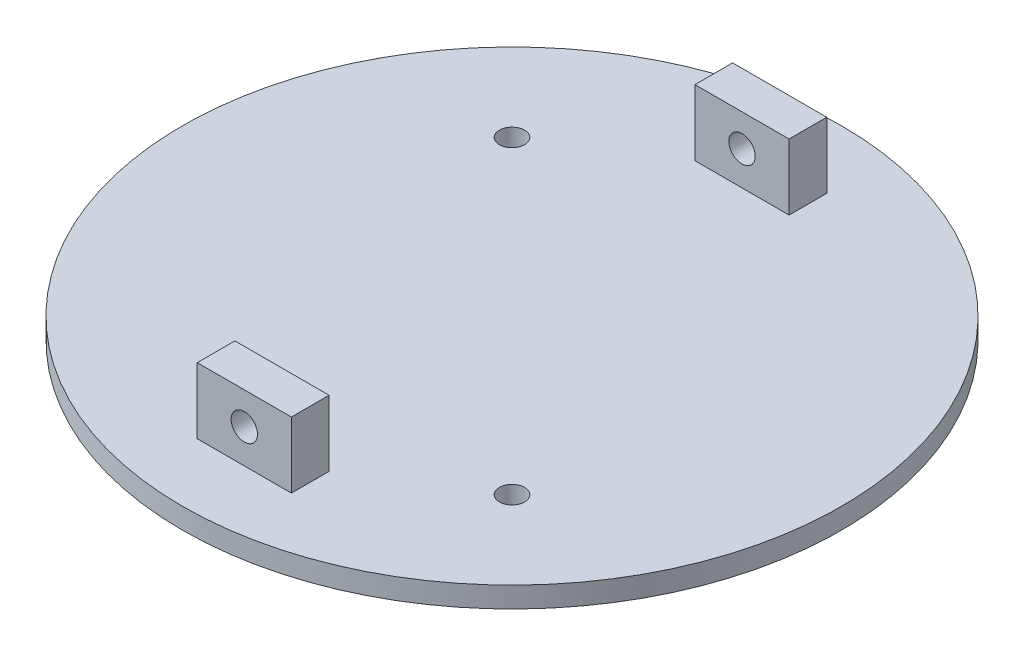
ISO-10303-21;
HEADER;
FILE_DESCRIPTION(('STEP AP214'),'2;1');
FILE_NAME('part.step','',(''),(''),'','','');
FILE_SCHEMA(('AUTOMOTIVE_DESIGN { 1 0 10303 214 1 1 1 1 }'));
ENDSEC;
DATA;
#1=APPLICATION_CONTEXT('core data for automotive mechanical design processes');
#2=APPLICATION_PROTOCOL_DEFINITION('international standard','automotive_design',2000,#1);
#3=PRODUCT_CONTEXT('',#1,'mechanical');
#4=PRODUCT('Part','Part','',(#3));
#5=PRODUCT_RELATED_PRODUCT_CATEGORY('part','',(#4));
#6=PRODUCT_DEFINITION_FORMATION('','',#4);
#7=PRODUCT_DEFINITION_CONTEXT('part definition',#1,'design');
#8=PRODUCT_DEFINITION('design','',#6,#7);
#9=PRODUCT_DEFINITION_SHAPE('','',#8);
#10=(LENGTH_UNIT() NAMED_UNIT(*) SI_UNIT(.MILLI.,.METRE.));
#11=(NAMED_UNIT(*) PLANE_ANGLE_UNIT() SI_UNIT($,.RADIAN.));
#12=(NAMED_UNIT(*) SI_UNIT($,.STERADIAN.) SOLID_ANGLE_UNIT());
#13=UNCERTAINTY_MEASURE_WITH_UNIT(LENGTH_MEASURE(1.E-05),#10,'distance_accuracy_value','');
#14=(GEOMETRIC_REPRESENTATION_CONTEXT(3) GLOBAL_UNCERTAINTY_ASSIGNED_CONTEXT((#13)) GLOBAL_UNIT_ASSIGNED_CONTEXT((#10,
#11,#12)) REPRESENTATION_CONTEXT('',''));
#15=CARTESIAN_POINT('',(0.,0.,0.));
#16=DIRECTION('',(0.,0.,1.));
#17=DIRECTION('',(1.,0.,0.));
#18=AXIS2_PLACEMENT_3D('',#15,#16,#17);
#19=CARTESIAN_POINT('',(44.45,2.794,-44.45));
#20=DIRECTION('',(0.,1.,0.));
#21=DIRECTION('',(0.,0.,1.));
#22=AXIS2_PLACEMENT_3D('',#19,#20,#21);
#23=PLANE('',#22);
#24=CARTESIAN_POINT('',(65.3140450398704,2.794,-23.5859549601296));
#25=DIRECTION('',(0.,1.,0.));
#26=DIRECTION('',(0.,0.,1.));
#27=AXIS2_PLACEMENT_3D('',#24,#25,#26);
#28=CIRCLE('',#27,1.7);
#29=CARTESIAN_POINT('',(65.3140450398704,2.794,-21.8859549601296));
#30=VERTEX_POINT('',#29);
#31=EDGE_CURVE('E187',#30,#30,#28,.T.);
#32=ORIENTED_EDGE('',*,*,#31,.F.);
#33=EDGE_LOOP('',(#32));
#34=FACE_BOUND('',#33,.T.);
#35=CARTESIAN_POINT('',(44.45,2.794,-44.45));
#36=DIRECTION('',(0.,1.,0.));
#37=DIRECTION('',(0.,0.,1.));
#38=AXIS2_PLACEMENT_3D('',#35,#36,#37);
#39=CIRCLE('',#38,44.45);
#40=CARTESIAN_POINT('',(44.45,2.794,0.));
#41=VERTEX_POINT('',#40);
#42=EDGE_CURVE('E11',#41,#41,#39,.T.);
#43=ORIENTED_EDGE('',*,*,#42,.T.);
#44=EDGE_LOOP('',(#43));
#45=FACE_BOUND('',#44,.T.);
#46=CARTESIAN_POINT('',(23.5859549601295,2.794,-65.3140450398704));
#47=DIRECTION('',(0.,1.,0.));
#48=DIRECTION('',(0.,0.,1.));
#49=AXIS2_PLACEMENT_3D('',#46,#47,#48);
#50=CIRCLE('',#49,1.7);
#51=CARTESIAN_POINT('',(23.5859549601295,2.794,-63.6140450398704));
#52=VERTEX_POINT('',#51);
#53=EDGE_CURVE('E179',#52,#52,#50,.T.);
#54=ORIENTED_EDGE('',*,*,#53,.F.);
#55=EDGE_LOOP('',(#54));
#56=FACE_BOUND('',#55,.T.);
#57=DIRECTION('',(-1.,0.,0.));
#58=VECTOR('',#57,1.);
#59=CARTESIAN_POINT('',(37.5559549601294,2.794,-13.97));
#60=LINE('',#59,#58);
#61=CARTESIAN_POINT('',(50.2559549601294,2.794,-13.97));
#62=VERTEX_POINT('',#61);
#63=CARTESIAN_POINT('',(37.5559549601294,2.794,-13.97));
#64=VERTEX_POINT('',#63);
#65=EDGE_CURVE('E139',#62,#64,#60,.T.);
#66=ORIENTED_EDGE('',*,*,#65,.F.);
#67=DIRECTION('',(0.,0.,-1.));
#68=VECTOR('',#67,1.);
#69=CARTESIAN_POINT('',(50.2559549601294,2.794,-13.97));
#70=LINE('',#69,#68);
#71=CARTESIAN_POINT('',(50.2559549601294,2.794,-8.88999999999995));
#72=VERTEX_POINT('',#71);
#73=EDGE_CURVE('E134',#72,#62,#70,.T.);
#74=ORIENTED_EDGE('',*,*,#73,.F.);
#75=DIRECTION('',(1.,0.,0.));
#76=VECTOR('',#75,1.);
#77=CARTESIAN_POINT('',(37.5559549601294,2.794,-8.89000000000001));
#78=LINE('',#77,#76);
#79=CARTESIAN_POINT('',(37.5559549601294,2.794,-8.89000000000001));
#80=VERTEX_POINT('',#79);
#81=EDGE_CURVE('E149',#80,#72,#78,.T.);
#82=ORIENTED_EDGE('',*,*,#81,.F.);
#83=DIRECTION('',(0.,0.,1.));
#84=VECTOR('',#83,1.);
#85=CARTESIAN_POINT('',(37.5559549601294,2.794,-13.97));
#86=LINE('',#85,#84);
#87=EDGE_CURVE('E161',#64,#80,#86,.T.);
#88=ORIENTED_EDGE('',*,*,#87,.F.);
#89=EDGE_LOOP('',(#66,#74,#82,#88));
#90=FACE_BOUND('',#89,.T.);
#91=DIRECTION('',(0.,0.,-1.));
#92=VECTOR('',#91,1.);
#93=CARTESIAN_POINT('',(51.3440450398708,2.794,-80.0099999999999));
#94=LINE('',#93,#92);
#95=CARTESIAN_POINT('',(51.3440450398708,2.794,-74.9299999999999));
#96=VERTEX_POINT('',#95);
#97=CARTESIAN_POINT('',(51.3440450398708,2.794,-80.0099999999999));
#98=VERTEX_POINT('',#97);
#99=EDGE_CURVE('E231',#96,#98,#94,.T.);
#100=ORIENTED_EDGE('',*,*,#99,.F.);
#101=DIRECTION('',(1.,0.,0.));
#102=VECTOR('',#101,1.);
#103=CARTESIAN_POINT('',(38.6440450398708,2.794,-74.93));
#104=LINE('',#103,#102);
#105=CARTESIAN_POINT('',(38.6440450398708,2.794,-74.93));
#106=VERTEX_POINT('',#105);
#107=EDGE_CURVE('E131',#106,#96,#104,.T.);
#108=ORIENTED_EDGE('',*,*,#107,.F.);
#109=DIRECTION('',(0.,0.,1.));
#110=VECTOR('',#109,1.);
#111=CARTESIAN_POINT('',(38.6440450398708,2.794,-80.01));
#112=LINE('',#111,#110);
#113=CARTESIAN_POINT('',(38.6440450398708,2.794,-80.01));
#114=VERTEX_POINT('',#113);
#115=EDGE_CURVE('E127',#114,#106,#112,.T.);
#116=ORIENTED_EDGE('',*,*,#115,.F.);
#117=DIRECTION('',(-1.,0.,0.));
#118=VECTOR('',#117,1.);
#119=CARTESIAN_POINT('',(38.6440450398708,2.794,-80.01));
#120=LINE('',#119,#118);
#121=EDGE_CURVE('E233',#98,#114,#120,.T.);
#122=ORIENTED_EDGE('',*,*,#121,.F.);
#123=EDGE_LOOP('',(#100,#108,#116,#122));
#124=FACE_BOUND('',#123,.T.);
#125=ADVANCED_FACE('F39',(#34,#45,#56,#90,#124),#23,.T.);
#126=CARTESIAN_POINT('',(44.45,0.,-44.45));
#127=DIRECTION('',(0.,1.,0.));
#128=DIRECTION('',(0.,0.,1.));
#129=AXIS2_PLACEMENT_3D('',#126,#127,#128);
#130=PLANE('',#129);
#131=CARTESIAN_POINT('',(44.45,0.,-44.45));
#132=DIRECTION('',(0.,1.,0.));
#133=DIRECTION('',(0.,0.,1.));
#134=AXIS2_PLACEMENT_3D('',#131,#132,#133);
#135=CIRCLE('',#134,44.45);
#136=CARTESIAN_POINT('',(44.45,0.,0.));
#137=VERTEX_POINT('',#136);
#138=EDGE_CURVE('E43',#137,#137,#135,.T.);
#139=ORIENTED_EDGE('',*,*,#138,.F.);
#140=EDGE_LOOP('',(#139));
#141=FACE_BOUND('',#140,.T.);
#142=CARTESIAN_POINT('',(65.3140450398704,0.,-23.5859549601296));
#143=DIRECTION('',(0.,1.,0.));
#144=DIRECTION('',(0.,0.,1.));
#145=AXIS2_PLACEMENT_3D('',#142,#143,#144);
#146=CIRCLE('',#145,1.7);
#147=CARTESIAN_POINT('',(65.3140450398704,0.,-21.8859549601296));
#148=VERTEX_POINT('',#147);
#149=EDGE_CURVE('E183',#148,#148,#146,.T.);
#150=ORIENTED_EDGE('',*,*,#149,.T.);
#151=EDGE_LOOP('',(#150));
#152=FACE_BOUND('',#151,.T.);
#153=CARTESIAN_POINT('',(23.5859549601295,0.,-65.3140450398704));
#154=DIRECTION('',(0.,1.,0.));
#155=DIRECTION('',(0.,0.,1.));
#156=AXIS2_PLACEMENT_3D('',#153,#154,#155);
#157=CIRCLE('',#156,1.7);
#158=CARTESIAN_POINT('',(23.5859549601295,0.,-63.6140450398704));
#159=VERTEX_POINT('',#158);
#160=EDGE_CURVE('E178',#159,#159,#157,.T.);
#161=ORIENTED_EDGE('',*,*,#160,.T.);
#162=EDGE_LOOP('',(#161));
#163=FACE_BOUND('',#162,.T.);
#164=ADVANCED_FACE('F195',(#141,#152,#163),#130,.F.);
#165=CARTESIAN_POINT('',(44.45,2.794,-44.45));
#166=DIRECTION('',(0.,-1.,0.));
#167=DIRECTION('',(0.,0.,-1.));
#168=AXIS2_PLACEMENT_3D('',#165,#166,#167);
#169=CYLINDRICAL_SURFACE('',#168,44.45);
#170=ORIENTED_EDGE('',*,*,#42,.F.);
#171=EDGE_LOOP('',(#170));
#172=FACE_BOUND('',#171,.T.);
#173=ORIENTED_EDGE('',*,*,#138,.T.);
#174=EDGE_LOOP('',(#173));
#175=FACE_BOUND('',#174,.T.);
#176=ADVANCED_FACE('F41',(#172,#175),#169,.T.);
#177=CARTESIAN_POINT('',(65.3140450398704,2.794,-23.5859549601296));
#178=DIRECTION('',(0.,-1.,0.));
#179=DIRECTION('',(0.,0.,-1.));
#180=AXIS2_PLACEMENT_3D('',#177,#178,#179);
#181=CYLINDRICAL_SURFACE('',#180,1.7);
#182=ORIENTED_EDGE('',*,*,#31,.T.);
#183=EDGE_LOOP('',(#182));
#184=FACE_BOUND('',#183,.T.);
#185=ORIENTED_EDGE('',*,*,#149,.F.);
#186=EDGE_LOOP('',(#185));
#187=FACE_BOUND('',#186,.T.);
#188=ADVANCED_FACE('F198',(#184,#187),#181,.F.);
#189=CARTESIAN_POINT('',(23.5859549601295,2.794,-65.3140450398704));
#190=DIRECTION('',(0.,-1.,0.));
#191=DIRECTION('',(0.,0.,-1.));
#192=AXIS2_PLACEMENT_3D('',#189,#190,#191);
#193=CYLINDRICAL_SURFACE('',#192,1.7);
#194=ORIENTED_EDGE('',*,*,#53,.T.);
#195=EDGE_LOOP('',(#194));
#196=FACE_BOUND('',#195,.T.);
#197=ORIENTED_EDGE('',*,*,#160,.F.);
#198=EDGE_LOOP('',(#197));
#199=FACE_BOUND('',#198,.T.);
#200=ADVANCED_FACE('F200',(#196,#199),#193,.F.);
#201=CARTESIAN_POINT('',(50.2559549601294,11.684,-13.97));
#202=DIRECTION('',(-1.,0.,0.));
#203=DIRECTION('',(0.,0.,1.));
#204=AXIS2_PLACEMENT_3D('',#201,#202,#203);
#205=PLANE('',#204);
#206=ORIENTED_EDGE('',*,*,#73,.T.);
#207=DIRECTION('',(0.,-1.,0.));
#208=VECTOR('',#207,1.);
#209=CARTESIAN_POINT('',(50.2559549601294,11.684,-13.97));
#210=LINE('',#209,#208);
#211=CARTESIAN_POINT('',(50.2559549601294,11.684,-13.97));
#212=VERTEX_POINT('',#211);
#213=EDGE_CURVE('E175',#212,#62,#210,.T.);
#214=ORIENTED_EDGE('',*,*,#213,.F.);
#215=DIRECTION('',(0.,0.,-1.));
#216=VECTOR('',#215,1.);
#217=CARTESIAN_POINT('',(50.2559549601294,11.684,-13.97));
#218=LINE('',#217,#216);
#219=CARTESIAN_POINT('',(50.2559549601294,11.684,-8.88999999999995));
#220=VERTEX_POINT('',#219);
#221=EDGE_CURVE('E144',#220,#212,#218,.T.);
#222=ORIENTED_EDGE('',*,*,#221,.F.);
#223=DIRECTION('',(0.,-1.,0.));
#224=VECTOR('',#223,1.);
#225=CARTESIAN_POINT('',(50.2559549601294,11.684,-8.88999999999995));
#226=LINE('',#225,#224);
#227=EDGE_CURVE('E157',#220,#72,#226,.T.);
#228=ORIENTED_EDGE('',*,*,#227,.T.);
#229=EDGE_LOOP('',(#206,#214,#222,#228));
#230=FACE_BOUND('',#229,.T.);
#231=ADVANCED_FACE('F207',(#230),#205,.F.);
#232=CARTESIAN_POINT('',(37.5559549601294,11.684,-13.97));
#233=DIRECTION('',(0.,0.,1.));
#234=DIRECTION('',(1.,0.,0.));
#235=AXIS2_PLACEMENT_3D('',#232,#233,#234);
#236=PLANE('',#235);
#237=CARTESIAN_POINT('',(43.9059549601294,7.366,-13.97));
#238=DIRECTION('',(0.,0.,1.));
#239=DIRECTION('',(1.,0.,0.));
#240=AXIS2_PLACEMENT_3D('',#237,#238,#239);
#241=CIRCLE('',#240,1.778);
#242=CARTESIAN_POINT('',(45.6839549601294,7.366,-13.97));
#243=VERTEX_POINT('',#242);
#244=EDGE_CURVE('E239',#243,#243,#241,.T.);
#245=ORIENTED_EDGE('',*,*,#244,.T.);
#246=EDGE_LOOP('',(#245));
#247=FACE_BOUND('',#246,.T.);
#248=ORIENTED_EDGE('',*,*,#65,.T.);
#249=DIRECTION('',(0.,-1.,0.));
#250=VECTOR('',#249,1.);
#251=CARTESIAN_POINT('',(37.5559549601294,11.684,-13.97));
#252=LINE('',#251,#250);
#253=CARTESIAN_POINT('',(37.5559549601294,11.684,-13.97));
#254=VERTEX_POINT('',#253);
#255=EDGE_CURVE('E171',#254,#64,#252,.T.);
#256=ORIENTED_EDGE('',*,*,#255,.F.);
#257=DIRECTION('',(-1.,0.,0.));
#258=VECTOR('',#257,1.);
#259=CARTESIAN_POINT('',(37.5559549601294,11.684,-13.97));
#260=LINE('',#259,#258);
#261=EDGE_CURVE('E148',#212,#254,#260,.T.);
#262=ORIENTED_EDGE('',*,*,#261,.F.);
#263=ORIENTED_EDGE('',*,*,#213,.T.);
#264=EDGE_LOOP('',(#248,#256,#262,#263));
#265=FACE_BOUND('',#264,.T.);
#266=ADVANCED_FACE('F301',(#247,#265),#236,.F.);
#267=CARTESIAN_POINT('',(37.5559549601294,11.684,-13.97));
#268=DIRECTION('',(1.,0.,0.));
#269=DIRECTION('',(0.,0.,-1.));
#270=AXIS2_PLACEMENT_3D('',#267,#268,#269);
#271=PLANE('',#270);
#272=ORIENTED_EDGE('',*,*,#87,.T.);
#273=DIRECTION('',(0.,-1.,0.));
#274=VECTOR('',#273,1.);
#275=CARTESIAN_POINT('',(37.5559549601294,11.684,-8.89000000000001));
#276=LINE('',#275,#274);
#277=CARTESIAN_POINT('',(37.5559549601294,11.684,-8.89000000000001));
#278=VERTEX_POINT('',#277);
#279=EDGE_CURVE('E63',#278,#80,#276,.T.);
#280=ORIENTED_EDGE('',*,*,#279,.F.);
#281=DIRECTION('',(0.,0.,1.));
#282=VECTOR('',#281,1.);
#283=CARTESIAN_POINT('',(37.5559549601294,11.684,-13.97));
#284=LINE('',#283,#282);
#285=EDGE_CURVE('E152',#254,#278,#284,.T.);
#286=ORIENTED_EDGE('',*,*,#285,.F.);
#287=ORIENTED_EDGE('',*,*,#255,.T.);
#288=EDGE_LOOP('',(#272,#280,#286,#287));
#289=FACE_BOUND('',#288,.T.);
#290=ADVANCED_FACE('F297',(#289),#271,.F.);
#291=CARTESIAN_POINT('',(37.5559549601294,11.684,-8.89000000000001));
#292=DIRECTION('',(0.,0.,-1.));
#293=DIRECTION('',(-1.,0.,0.));
#294=AXIS2_PLACEMENT_3D('',#291,#292,#293);
#295=PLANE('',#294);
#296=CARTESIAN_POINT('',(43.9059549601294,7.366,-8.89000000000017));
#297=DIRECTION('',(0.,0.,1.));
#298=DIRECTION('',(1.,0.,0.));
#299=AXIS2_PLACEMENT_3D('',#296,#297,#298);
#300=CIRCLE('',#299,1.778);
#301=CARTESIAN_POINT('',(45.6839549601294,7.366,-8.89000000000017));
#302=VERTEX_POINT('',#301);
#303=EDGE_CURVE('E255',#302,#302,#300,.T.);
#304=ORIENTED_EDGE('',*,*,#303,.F.);
#305=EDGE_LOOP('',(#304));
#306=FACE_BOUND('',#305,.T.);
#307=ORIENTED_EDGE('',*,*,#81,.T.);
#308=ORIENTED_EDGE('',*,*,#227,.F.);
#309=DIRECTION('',(1.,0.,0.));
#310=VECTOR('',#309,1.);
#311=CARTESIAN_POINT('',(37.5559549601294,11.684,-8.89000000000001));
#312=LINE('',#311,#310);
#313=EDGE_CURVE('E155',#278,#220,#312,.T.);
#314=ORIENTED_EDGE('',*,*,#313,.F.);
#315=ORIENTED_EDGE('',*,*,#279,.T.);
#316=EDGE_LOOP('',(#307,#308,#314,#315));
#317=FACE_BOUND('',#316,.T.);
#318=ADVANCED_FACE('F293',(#306,#317),#295,.F.);
#319=CARTESIAN_POINT('',(0.,11.684,0.));
#320=DIRECTION('',(0.,1.,0.));
#321=DIRECTION('',(0.,0.,1.));
#322=AXIS2_PLACEMENT_3D('',#319,#320,#321);
#323=PLANE('',#322);
#324=ORIENTED_EDGE('',*,*,#221,.T.);
#325=ORIENTED_EDGE('',*,*,#261,.T.);
#326=ORIENTED_EDGE('',*,*,#285,.T.);
#327=ORIENTED_EDGE('',*,*,#313,.T.);
#328=EDGE_LOOP('',(#324,#325,#326,#327));
#329=FACE_BOUND('',#328,.T.);
#330=ADVANCED_FACE('F289',(#329),#323,.T.);
#331=CARTESIAN_POINT('',(38.6440450398708,11.684,-74.93));
#332=DIRECTION('',(0.,0.,-1.));
#333=DIRECTION('',(-1.,0.,0.));
#334=AXIS2_PLACEMENT_3D('',#331,#332,#333);
#335=PLANE('',#334);
#336=CARTESIAN_POINT('',(44.9940450398706,7.366,-74.93));
#337=DIRECTION('',(0.,0.,-1.));
#338=DIRECTION('',(-1.,0.,0.));
#339=AXIS2_PLACEMENT_3D('',#336,#337,#338);
#340=CIRCLE('',#339,1.778);
#341=CARTESIAN_POINT('',(43.2160450398706,7.366,-74.93));
#342=VERTEX_POINT('',#341);
#343=EDGE_CURVE('E259',#342,#342,#340,.T.);
#344=ORIENTED_EDGE('',*,*,#343,.T.);
#345=EDGE_LOOP('',(#344));
#346=FACE_BOUND('',#345,.T.);
#347=ORIENTED_EDGE('',*,*,#107,.T.);
#348=DIRECTION('',(0.,-1.,0.));
#349=VECTOR('',#348,1.);
#350=CARTESIAN_POINT('',(51.3440450398708,11.684,-74.9299999999999));
#351=LINE('',#350,#349);
#352=CARTESIAN_POINT('',(51.3440450398708,11.684,-74.9299999999999));
#353=VERTEX_POINT('',#352);
#354=EDGE_CURVE('E110',#353,#96,#351,.T.);
#355=ORIENTED_EDGE('',*,*,#354,.F.);
#356=DIRECTION('',(1.,0.,0.));
#357=VECTOR('',#356,1.);
#358=CARTESIAN_POINT('',(38.6440450398708,11.684,-74.93));
#359=LINE('',#358,#357);
#360=CARTESIAN_POINT('',(38.6440450398708,11.684,-74.93));
#361=VERTEX_POINT('',#360);
#362=EDGE_CURVE('E118',#361,#353,#359,.T.);
#363=ORIENTED_EDGE('',*,*,#362,.F.);
#364=DIRECTION('',(0.,-1.,0.));
#365=VECTOR('',#364,1.);
#366=CARTESIAN_POINT('',(38.6440450398708,11.684,-74.93));
#367=LINE('',#366,#365);
#368=EDGE_CURVE('E245',#361,#106,#367,.T.);
#369=ORIENTED_EDGE('',*,*,#368,.T.);
#370=EDGE_LOOP('',(#347,#355,#363,#369));
#371=FACE_BOUND('',#370,.T.);
#372=ADVANCED_FACE('F129',(#346,#371),#335,.F.);
#373=CARTESIAN_POINT('',(51.3440450398708,11.684,-80.0099999999999));
#374=DIRECTION('',(-1.,0.,0.));
#375=DIRECTION('',(0.,0.,1.));
#376=AXIS2_PLACEMENT_3D('',#373,#374,#375);
#377=PLANE('',#376);
#378=ORIENTED_EDGE('',*,*,#99,.T.);
#379=DIRECTION('',(0.,-1.,0.));
#380=VECTOR('',#379,1.);
#381=CARTESIAN_POINT('',(51.3440450398708,11.684,-80.0099999999999));
#382=LINE('',#381,#380);
#383=CARTESIAN_POINT('',(51.3440450398708,11.684,-80.0099999999999));
#384=VERTEX_POINT('',#383);
#385=EDGE_CURVE('E113',#384,#98,#382,.T.);
#386=ORIENTED_EDGE('',*,*,#385,.F.);
#387=DIRECTION('',(0.,0.,-1.));
#388=VECTOR('',#387,1.);
#389=CARTESIAN_POINT('',(51.3440450398708,11.684,-80.0099999999999));
#390=LINE('',#389,#388);
#391=EDGE_CURVE('E106',#353,#384,#390,.T.);
#392=ORIENTED_EDGE('',*,*,#391,.F.);
#393=ORIENTED_EDGE('',*,*,#354,.T.);
#394=EDGE_LOOP('',(#378,#386,#392,#393));
#395=FACE_BOUND('',#394,.T.);
#396=ADVANCED_FACE('F108',(#395),#377,.F.);
#397=CARTESIAN_POINT('',(38.6440450398708,11.684,-80.01));
#398=DIRECTION('',(0.,0.,1.));
#399=DIRECTION('',(1.,0.,0.));
#400=AXIS2_PLACEMENT_3D('',#397,#398,#399);
#401=PLANE('',#400);
#402=CARTESIAN_POINT('',(44.9940450398706,7.366,-80.0099999999998));
#403=DIRECTION('',(0.,0.,-1.));
#404=DIRECTION('',(-1.,0.,0.));
#405=AXIS2_PLACEMENT_3D('',#402,#403,#404);
#406=CIRCLE('',#405,1.778);
#407=CARTESIAN_POINT('',(43.2160450398706,7.366,-80.0099999999998));
#408=VERTEX_POINT('',#407);
#409=EDGE_CURVE('E263',#408,#408,#406,.T.);
#410=ORIENTED_EDGE('',*,*,#409,.F.);
#411=EDGE_LOOP('',(#410));
#412=FACE_BOUND('',#411,.T.);
#413=ORIENTED_EDGE('',*,*,#121,.T.);
#414=DIRECTION('',(0.,-1.,0.));
#415=VECTOR('',#414,1.);
#416=CARTESIAN_POINT('',(38.6440450398708,11.684,-80.01));
#417=LINE('',#416,#415);
#418=CARTESIAN_POINT('',(38.6440450398708,11.684,-80.01));
#419=VERTEX_POINT('',#418);
#420=EDGE_CURVE('E55',#419,#114,#417,.T.);
#421=ORIENTED_EDGE('',*,*,#420,.F.);
#422=DIRECTION('',(-1.,0.,0.));
#423=VECTOR('',#422,1.);
#424=CARTESIAN_POINT('',(38.6440450398708,11.684,-80.01));
#425=LINE('',#424,#423);
#426=EDGE_CURVE('E117',#384,#419,#425,.T.);
#427=ORIENTED_EDGE('',*,*,#426,.F.);
#428=ORIENTED_EDGE('',*,*,#385,.T.);
#429=EDGE_LOOP('',(#413,#421,#427,#428));
#430=FACE_BOUND('',#429,.T.);
#431=ADVANCED_FACE('F271',(#412,#430),#401,.F.);
#432=CARTESIAN_POINT('',(38.6440450398708,11.684,-80.01));
#433=DIRECTION('',(1.,0.,0.));
#434=DIRECTION('',(0.,0.,-1.));
#435=AXIS2_PLACEMENT_3D('',#432,#433,#434);
#436=PLANE('',#435);
#437=ORIENTED_EDGE('',*,*,#115,.T.);
#438=ORIENTED_EDGE('',*,*,#368,.F.);
#439=DIRECTION('',(0.,0.,1.));
#440=VECTOR('',#439,1.);
#441=CARTESIAN_POINT('',(38.6440450398708,11.684,-80.01));
#442=LINE('',#441,#440);
#443=EDGE_CURVE('E122',#419,#361,#442,.T.);
#444=ORIENTED_EDGE('',*,*,#443,.F.);
#445=ORIENTED_EDGE('',*,*,#420,.T.);
#446=EDGE_LOOP('',(#437,#438,#444,#445));
#447=FACE_BOUND('',#446,.T.);
#448=ADVANCED_FACE('F274',(#447),#436,.F.);
#449=CARTESIAN_POINT('',(0.,11.684,0.));
#450=DIRECTION('',(0.,-1.,0.));
#451=DIRECTION('',(0.,0.,-1.));
#452=AXIS2_PLACEMENT_3D('',#449,#450,#451);
#453=PLANE('',#452);
#454=ORIENTED_EDGE('',*,*,#362,.T.);
#455=ORIENTED_EDGE('',*,*,#391,.T.);
#456=ORIENTED_EDGE('',*,*,#426,.T.);
#457=ORIENTED_EDGE('',*,*,#443,.T.);
#458=EDGE_LOOP('',(#454,#455,#456,#457));
#459=FACE_BOUND('',#458,.T.);
#460=ADVANCED_FACE('F121',(#459),#453,.F.);
#461=CARTESIAN_POINT('',(43.9059549601294,7.366,-22.0980000000002));
#462=DIRECTION('',(0.,0.,1.));
#463=DIRECTION('',(1.,0.,0.));
#464=AXIS2_PLACEMENT_3D('',#461,#462,#463);
#465=CYLINDRICAL_SURFACE('',#464,1.778);
#466=ORIENTED_EDGE('',*,*,#303,.T.);
#467=EDGE_LOOP('',(#466));
#468=FACE_BOUND('',#467,.T.);
#469=ORIENTED_EDGE('',*,*,#244,.F.);
#470=EDGE_LOOP('',(#469));
#471=FACE_BOUND('',#470,.T.);
#472=ADVANCED_FACE('F281',(#468,#471),#465,.F.);
#473=CARTESIAN_POINT('',(44.9940450398706,7.366,-66.8019999999998));
#474=DIRECTION('',(0.,0.,-1.));
#475=DIRECTION('',(-1.,0.,0.));
#476=AXIS2_PLACEMENT_3D('',#473,#474,#475);
#477=CYLINDRICAL_SURFACE('',#476,1.778);
#478=ORIENTED_EDGE('',*,*,#409,.T.);
#479=EDGE_LOOP('',(#478));
#480=FACE_BOUND('',#479,.T.);
#481=ORIENTED_EDGE('',*,*,#343,.F.);
#482=EDGE_LOOP('',(#481));
#483=FACE_BOUND('',#482,.T.);
#484=ADVANCED_FACE('F268',(#480,#483),#477,.F.);
#485=CLOSED_SHELL('',(#125,#164,#176,#188,#200,#231,#266,#290,#318,#330,#372,#396,#431,#448,
#460,#472,#484));
#486=MANIFOLD_SOLID_BREP('B2',#485);
#487=ADVANCED_BREP_SHAPE_REPRESENTATION('',(#18,#486),#14);
#488=SHAPE_DEFINITION_REPRESENTATION(#9,#487);
ENDSEC;
END-ISO-10303-21;
